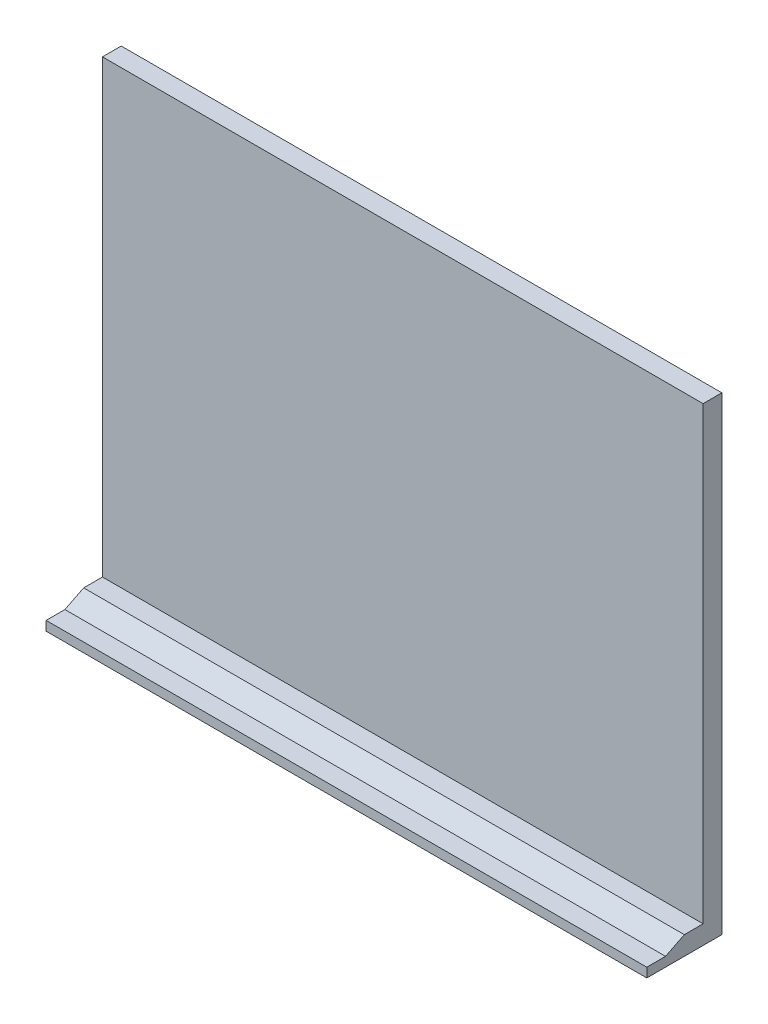
ISO-10303-21;
HEADER;
FILE_DESCRIPTION(('STEP AP214'),'2;1');
FILE_NAME('part.step','',(''),(''),'','','');
FILE_SCHEMA(('AUTOMOTIVE_DESIGN { 1 0 10303 214 1 1 1 1 }'));
ENDSEC;
DATA;
#1=APPLICATION_CONTEXT('core data for automotive mechanical design processes');
#2=APPLICATION_PROTOCOL_DEFINITION('international standard','automotive_design',2000,#1);
#3=PRODUCT_CONTEXT('',#1,'mechanical');
#4=PRODUCT('Part','Part','',(#3));
#5=PRODUCT_RELATED_PRODUCT_CATEGORY('part','',(#4));
#6=PRODUCT_DEFINITION_FORMATION('','',#4);
#7=PRODUCT_DEFINITION_CONTEXT('part definition',#1,'design');
#8=PRODUCT_DEFINITION('design','',#6,#7);
#9=PRODUCT_DEFINITION_SHAPE('','',#8);
#10=(LENGTH_UNIT() NAMED_UNIT(*) SI_UNIT(.MILLI.,.METRE.));
#11=(NAMED_UNIT(*) PLANE_ANGLE_UNIT() SI_UNIT($,.RADIAN.));
#12=(NAMED_UNIT(*) SI_UNIT($,.STERADIAN.) SOLID_ANGLE_UNIT());
#13=UNCERTAINTY_MEASURE_WITH_UNIT(LENGTH_MEASURE(1.E-05),#10,'distance_accuracy_value','');
#14=(GEOMETRIC_REPRESENTATION_CONTEXT(3) GLOBAL_UNCERTAINTY_ASSIGNED_CONTEXT((#13)) GLOBAL_UNIT_ASSIGNED_CONTEXT((#10,
#11,#12)) REPRESENTATION_CONTEXT('',''));
#15=CARTESIAN_POINT('',(0.,0.,0.));
#16=DIRECTION('',(0.,0.,1.));
#17=DIRECTION('',(1.,0.,0.));
#18=AXIS2_PLACEMENT_3D('',#15,#16,#17);
#19=CARTESIAN_POINT('',(-0.01000000000001,3.17499999999996,19.05));
#20=DIRECTION('',(0.,-0.894427190999916,-0.447213595499958));
#21=DIRECTION('',(0.,0.447213595499958,-0.894427190999916));
#22=AXIS2_PLACEMENT_3D('',#19,#20,#21);
#23=PLANE('',#22);
#24=DIRECTION('',(1.,0.,0.));
#25=VECTOR('',#24,1.);
#26=CARTESIAN_POINT('',(-0.01000000000001,3.17499999999996,19.05));
#27=LINE('',#26,#25);
#28=CARTESIAN_POINT('',(0.,3.17499999999995,19.05));
#29=VERTEX_POINT('',#28);
#30=CARTESIAN_POINT('',(203.2,3.17499999999998,19.05));
#31=VERTEX_POINT('',#30);
#32=EDGE_CURVE('E11',#29,#31,#27,.T.);
#33=ORIENTED_EDGE('',*,*,#32,.T.);
#34=DIRECTION('',(0.,-0.447213595499958,0.894427190999916));
#35=VECTOR('',#34,1.);
#36=CARTESIAN_POINT('',(203.2,39.37,-53.34));
#37=LINE('',#36,#35);
#38=CARTESIAN_POINT('',(203.2,6.35,12.7));
#39=VERTEX_POINT('',#38);
#40=EDGE_CURVE('E119',#39,#31,#37,.T.);
#41=ORIENTED_EDGE('',*,*,#40,.F.);
#42=DIRECTION('',(-1.,0.,0.));
#43=VECTOR('',#42,1.);
#44=CARTESIAN_POINT('',(0.,6.35,12.7));
#45=LINE('',#44,#43);
#46=CARTESIAN_POINT('',(0.,6.35,12.7));
#47=VERTEX_POINT('',#46);
#48=EDGE_CURVE('E42',#39,#47,#45,.T.);
#49=ORIENTED_EDGE('',*,*,#48,.T.);
#50=DIRECTION('',(0.,0.447213595499958,-0.894427190999916));
#51=VECTOR('',#50,1.);
#52=CARTESIAN_POINT('',(0.,39.37,-53.34));
#53=LINE('',#52,#51);
#54=EDGE_CURVE('E57',#29,#47,#53,.T.);
#55=ORIENTED_EDGE('',*,*,#54,.F.);
#56=EDGE_LOOP('',(#33,#41,#49,#55));
#57=FACE_BOUND('',#56,.T.);
#58=ADVANCED_FACE('F33',(#57),#23,.F.);
#59=CARTESIAN_POINT('',(-0.01000000000001,3.17499999999996,25.4));
#60=DIRECTION('',(0.,-1.,0.));
#61=DIRECTION('',(1.,0.,0.));
#62=AXIS2_PLACEMENT_3D('',#59,#60,#61);
#63=PLANE('',#62);
#64=DIRECTION('',(1.,0.,0.));
#65=VECTOR('',#64,1.);
#66=CARTESIAN_POINT('',(0.,3.17499999999996,25.4));
#67=LINE('',#66,#65);
#68=CARTESIAN_POINT('',(0.,3.17499999999998,25.4));
#69=VERTEX_POINT('',#68);
#70=CARTESIAN_POINT('',(203.2,3.17499999999998,25.4));
#71=VERTEX_POINT('',#70);
#72=EDGE_CURVE('E108',#69,#71,#67,.T.);
#73=ORIENTED_EDGE('',*,*,#72,.T.);
#74=DIRECTION('',(0.,0.,1.));
#75=VECTOR('',#74,1.);
#76=CARTESIAN_POINT('',(203.2,3.17499999999998,6.35));
#77=LINE('',#76,#75);
#78=EDGE_CURVE('E157',#31,#71,#77,.T.);
#79=ORIENTED_EDGE('',*,*,#78,.F.);
#80=ORIENTED_EDGE('',*,*,#32,.F.);
#81=DIRECTION('',(0.,0.,-1.));
#82=VECTOR('',#81,1.);
#83=CARTESIAN_POINT('',(0.,3.17499999999996,6.35));
#84=LINE('',#83,#82);
#85=EDGE_CURVE('E37',#69,#29,#84,.T.);
#86=ORIENTED_EDGE('',*,*,#85,.F.);
#87=EDGE_LOOP('',(#73,#79,#80,#86));
#88=FACE_BOUND('',#87,.T.);
#89=ADVANCED_FACE('F35',(#88),#63,.F.);
#90=CARTESIAN_POINT('',(0.,6.35,25.4));
#91=DIRECTION('',(0.,-1.,0.));
#92=DIRECTION('',(0.,0.,-1.));
#93=AXIS2_PLACEMENT_3D('',#90,#91,#92);
#94=PLANE('',#93);
#95=ORIENTED_EDGE('',*,*,#48,.F.);
#96=DIRECTION('',(0.,0.,-1.));
#97=VECTOR('',#96,1.);
#98=CARTESIAN_POINT('',(203.2,6.35,25.4));
#99=LINE('',#98,#97);
#100=CARTESIAN_POINT('',(203.2,6.35000000000005,6.35));
#101=VERTEX_POINT('',#100);
#102=EDGE_CURVE('E133',#39,#101,#99,.T.);
#103=ORIENTED_EDGE('',*,*,#102,.T.);
#104=DIRECTION('',(-1.,0.,0.));
#105=VECTOR('',#104,1.);
#106=CARTESIAN_POINT('',(0.,6.35,6.35));
#107=LINE('',#106,#105);
#108=CARTESIAN_POINT('',(0.,6.35,6.35));
#109=VERTEX_POINT('',#108);
#110=EDGE_CURVE('E109',#101,#109,#107,.T.);
#111=ORIENTED_EDGE('',*,*,#110,.T.);
#112=DIRECTION('',(0.,0.,-1.));
#113=VECTOR('',#112,1.);
#114=CARTESIAN_POINT('',(0.,6.35,25.4));
#115=LINE('',#114,#113);
#116=EDGE_CURVE('E126',#47,#109,#115,.T.);
#117=ORIENTED_EDGE('',*,*,#116,.F.);
#118=EDGE_LOOP('',(#95,#103,#111,#117));
#119=FACE_BOUND('',#118,.T.);
#120=ADVANCED_FACE('F163',(#119),#94,.F.);
#121=CARTESIAN_POINT('',(0.,158.75,6.35));
#122=DIRECTION('',(1.,0.,0.));
#123=DIRECTION('',(0.,1.,0.));
#124=AXIS2_PLACEMENT_3D('',#121,#122,#123);
#125=PLANE('',#124);
#126=DIRECTION('',(0.,-1.,0.));
#127=VECTOR('',#126,1.);
#128=CARTESIAN_POINT('',(0.,6.35,25.4));
#129=LINE('',#128,#127);
#130=CARTESIAN_POINT('',(0.,0.,25.4));
#131=VERTEX_POINT('',#130);
#132=EDGE_CURVE('E100',#69,#131,#129,.T.);
#133=ORIENTED_EDGE('',*,*,#132,.F.);
#134=ORIENTED_EDGE('',*,*,#85,.T.);
#135=ORIENTED_EDGE('',*,*,#54,.T.);
#136=ORIENTED_EDGE('',*,*,#116,.T.);
#137=DIRECTION('',(0.,-1.,0.));
#138=VECTOR('',#137,1.);
#139=CARTESIAN_POINT('',(0.,158.75,6.35));
#140=LINE('',#139,#138);
#141=CARTESIAN_POINT('',(0.,158.75,6.35));
#142=VERTEX_POINT('',#141);
#143=EDGE_CURVE('E135',#142,#109,#140,.T.);
#144=ORIENTED_EDGE('',*,*,#143,.F.);
#145=DIRECTION('',(0.,0.,-1.));
#146=VECTOR('',#145,1.);
#147=CARTESIAN_POINT('',(0.,158.75,6.35));
#148=LINE('',#147,#146);
#149=CARTESIAN_POINT('',(0.,158.75,0.));
#150=VERTEX_POINT('',#149);
#151=EDGE_CURVE('E143',#142,#150,#148,.T.);
#152=ORIENTED_EDGE('',*,*,#151,.T.);
#153=DIRECTION('',(0.,-1.,0.));
#154=VECTOR('',#153,1.);
#155=CARTESIAN_POINT('',(0.,158.75,0.));
#156=LINE('',#155,#154);
#157=CARTESIAN_POINT('',(0.,0.,0.));
#158=VERTEX_POINT('',#157);
#159=EDGE_CURVE('E117',#150,#158,#156,.T.);
#160=ORIENTED_EDGE('',*,*,#159,.T.);
#161=DIRECTION('',(0.,0.,-1.));
#162=VECTOR('',#161,1.);
#163=CARTESIAN_POINT('',(0.,0.,6.35));
#164=LINE('',#163,#162);
#165=EDGE_CURVE('E113',#131,#158,#164,.T.);
#166=ORIENTED_EDGE('',*,*,#165,.F.);
#167=EDGE_LOOP('',(#133,#134,#135,#136,#144,#152,#160,#166));
#168=FACE_BOUND('',#167,.T.);
#169=ADVANCED_FACE('F114',(#168),#125,.F.);
#170=CARTESIAN_POINT('',(0.,0.,6.35));
#171=DIRECTION('',(0.,1.,0.));
#172=DIRECTION('',(0.,0.,1.));
#173=AXIS2_PLACEMENT_3D('',#170,#171,#172);
#174=PLANE('',#173);
#175=DIRECTION('',(1.,0.,0.));
#176=VECTOR('',#175,1.);
#177=CARTESIAN_POINT('',(0.,0.,0.));
#178=LINE('',#177,#176);
#179=CARTESIAN_POINT('',(203.2,0.,0.));
#180=VERTEX_POINT('',#179);
#181=EDGE_CURVE('E145',#158,#180,#178,.T.);
#182=ORIENTED_EDGE('',*,*,#181,.T.);
#183=DIRECTION('',(0.,0.,-1.));
#184=VECTOR('',#183,1.);
#185=CARTESIAN_POINT('',(203.2,0.,6.35));
#186=LINE('',#185,#184);
#187=CARTESIAN_POINT('',(203.2,0.,25.4));
#188=VERTEX_POINT('',#187);
#189=EDGE_CURVE('E120',#188,#180,#186,.T.);
#190=ORIENTED_EDGE('',*,*,#189,.F.);
#191=DIRECTION('',(1.,0.,0.));
#192=VECTOR('',#191,1.);
#193=CARTESIAN_POINT('',(0.,0.,25.4));
#194=LINE('',#193,#192);
#195=EDGE_CURVE('E105',#131,#188,#194,.T.);
#196=ORIENTED_EDGE('',*,*,#195,.F.);
#197=ORIENTED_EDGE('',*,*,#165,.T.);
#198=EDGE_LOOP('',(#182,#190,#196,#197));
#199=FACE_BOUND('',#198,.T.);
#200=ADVANCED_FACE('F122',(#199),#174,.F.);
#201=CARTESIAN_POINT('',(203.2,158.75,6.35));
#202=DIRECTION('',(-1.,0.,0.));
#203=DIRECTION('',(0.,-1.,0.));
#204=AXIS2_PLACEMENT_3D('',#201,#202,#203);
#205=PLANE('',#204);
#206=ORIENTED_EDGE('',*,*,#40,.T.);
#207=ORIENTED_EDGE('',*,*,#78,.T.);
#208=DIRECTION('',(0.,1.,0.));
#209=VECTOR('',#208,1.);
#210=CARTESIAN_POINT('',(203.2,6.35,25.4));
#211=LINE('',#210,#209);
#212=EDGE_CURVE('E124',#188,#71,#211,.T.);
#213=ORIENTED_EDGE('',*,*,#212,.F.);
#214=ORIENTED_EDGE('',*,*,#189,.T.);
#215=DIRECTION('',(0.,1.,0.));
#216=VECTOR('',#215,1.);
#217=CARTESIAN_POINT('',(203.2,158.75,0.));
#218=LINE('',#217,#216);
#219=CARTESIAN_POINT('',(203.2,158.75,0.));
#220=VERTEX_POINT('',#219);
#221=EDGE_CURVE('E147',#180,#220,#218,.T.);
#222=ORIENTED_EDGE('',*,*,#221,.T.);
#223=DIRECTION('',(0.,0.,-1.));
#224=VECTOR('',#223,1.);
#225=CARTESIAN_POINT('',(203.2,158.75,6.35));
#226=LINE('',#225,#224);
#227=CARTESIAN_POINT('',(203.2,158.75,6.35));
#228=VERTEX_POINT('',#227);
#229=EDGE_CURVE('E151',#228,#220,#226,.T.);
#230=ORIENTED_EDGE('',*,*,#229,.F.);
#231=DIRECTION('',(0.,1.,0.));
#232=VECTOR('',#231,1.);
#233=CARTESIAN_POINT('',(203.2,158.75,6.35));
#234=LINE('',#233,#232);
#235=EDGE_CURVE('E138',#101,#228,#234,.T.);
#236=ORIENTED_EDGE('',*,*,#235,.F.);
#237=ORIENTED_EDGE('',*,*,#102,.F.);
#238=EDGE_LOOP('',(#206,#207,#213,#214,#222,#230,#236,#237));
#239=FACE_BOUND('',#238,.T.);
#240=ADVANCED_FACE('F179',(#239),#205,.F.);
#241=CARTESIAN_POINT('',(0.,158.75,6.35));
#242=DIRECTION('',(0.,-1.,0.));
#243=DIRECTION('',(0.,0.,-1.));
#244=AXIS2_PLACEMENT_3D('',#241,#242,#243);
#245=PLANE('',#244);
#246=DIRECTION('',(-1.,0.,0.));
#247=VECTOR('',#246,1.);
#248=CARTESIAN_POINT('',(0.,158.75,0.));
#249=LINE('',#248,#247);
#250=EDGE_CURVE('E139',#220,#150,#249,.T.);
#251=ORIENTED_EDGE('',*,*,#250,.T.);
#252=ORIENTED_EDGE('',*,*,#151,.F.);
#253=DIRECTION('',(-1.,0.,0.));
#254=VECTOR('',#253,1.);
#255=CARTESIAN_POINT('',(0.,158.75,6.35));
#256=LINE('',#255,#254);
#257=EDGE_CURVE('E141',#228,#142,#256,.T.);
#258=ORIENTED_EDGE('',*,*,#257,.F.);
#259=ORIENTED_EDGE('',*,*,#229,.T.);
#260=EDGE_LOOP('',(#251,#252,#258,#259));
#261=FACE_BOUND('',#260,.T.);
#262=ADVANCED_FACE('F173',(#261),#245,.F.);
#263=CARTESIAN_POINT('',(0.,0.,6.35));
#264=DIRECTION('',(0.,0.,1.));
#265=DIRECTION('',(1.,0.,0.));
#266=AXIS2_PLACEMENT_3D('',#263,#264,#265);
#267=PLANE('',#266);
#268=ORIENTED_EDGE('',*,*,#110,.F.);
#269=ORIENTED_EDGE('',*,*,#235,.T.);
#270=ORIENTED_EDGE('',*,*,#257,.T.);
#271=ORIENTED_EDGE('',*,*,#143,.T.);
#272=EDGE_LOOP('',(#268,#269,#270,#271));
#273=FACE_BOUND('',#272,.T.);
#274=ADVANCED_FACE('F167',(#273),#267,.T.);
#275=CARTESIAN_POINT('',(0.,0.,0.));
#276=DIRECTION('',(0.,0.,1.));
#277=DIRECTION('',(1.,0.,0.));
#278=AXIS2_PLACEMENT_3D('',#275,#276,#277);
#279=PLANE('',#278);
#280=ORIENTED_EDGE('',*,*,#159,.F.);
#281=ORIENTED_EDGE('',*,*,#250,.F.);
#282=ORIENTED_EDGE('',*,*,#221,.F.);
#283=ORIENTED_EDGE('',*,*,#181,.F.);
#284=EDGE_LOOP('',(#280,#281,#282,#283));
#285=FACE_BOUND('',#284,.T.);
#286=ADVANCED_FACE('F176',(#285),#279,.F.);
#287=CARTESIAN_POINT('',(0.,0.,25.4));
#288=DIRECTION('',(0.,0.,1.));
#289=DIRECTION('',(1.,0.,0.));
#290=AXIS2_PLACEMENT_3D('',#287,#288,#289);
#291=PLANE('',#290);
#292=ORIENTED_EDGE('',*,*,#72,.F.);
#293=ORIENTED_EDGE('',*,*,#132,.T.);
#294=ORIENTED_EDGE('',*,*,#195,.T.);
#295=ORIENTED_EDGE('',*,*,#212,.T.);
#296=EDGE_LOOP('',(#292,#293,#294,#295));
#297=FACE_BOUND('',#296,.T.);
#298=ADVANCED_FACE('F102',(#297),#291,.T.);
#299=CLOSED_SHELL('',(#58,#89,#120,#169,#200,#240,#262,#274,#286,#298));
#300=MANIFOLD_SOLID_BREP('B2',#299);
#301=ADVANCED_BREP_SHAPE_REPRESENTATION('',(#18,#300),#14);
#302=SHAPE_DEFINITION_REPRESENTATION(#9,#301);
ENDSEC;
END-ISO-10303-21;
